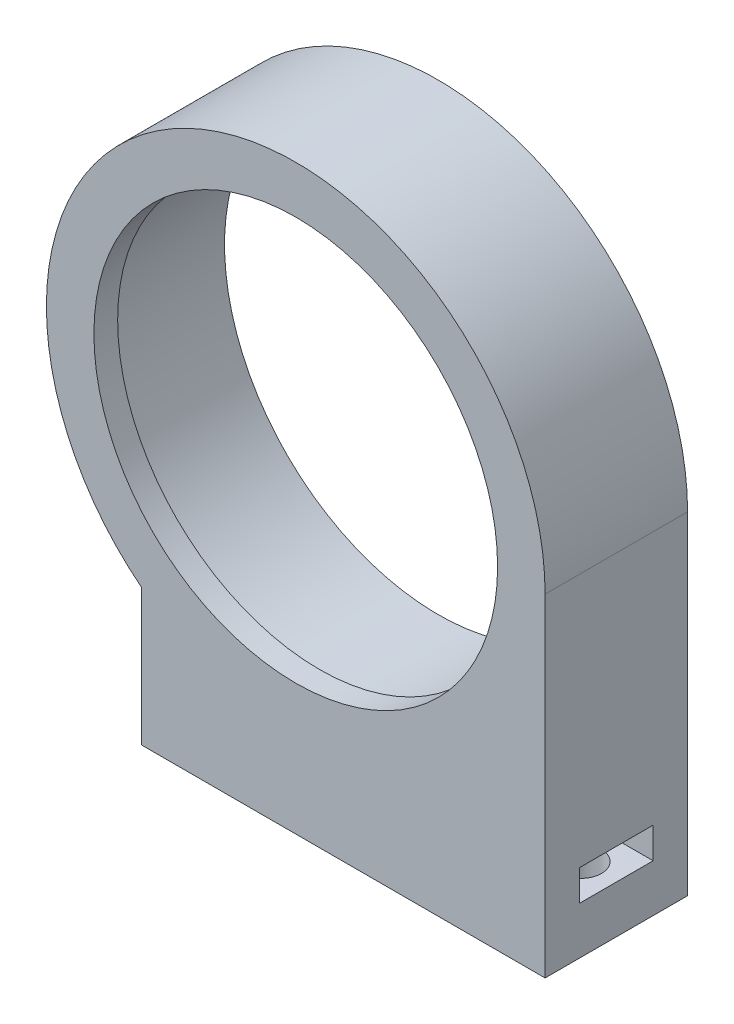
ISO-10303-21;
HEADER;
FILE_DESCRIPTION(('STEP AP214'),'2;1');
FILE_NAME('part.step','',(''),(''),'','','');
FILE_SCHEMA(('AUTOMOTIVE_DESIGN { 1 0 10303 214 1 1 1 1 }'));
ENDSEC;
DATA;
#1=APPLICATION_CONTEXT('core data for automotive mechanical design processes');
#2=APPLICATION_PROTOCOL_DEFINITION('international standard','automotive_design',2000,#1);
#3=PRODUCT_CONTEXT('',#1,'mechanical');
#4=PRODUCT('Part','Part','',(#3));
#5=PRODUCT_RELATED_PRODUCT_CATEGORY('part','',(#4));
#6=PRODUCT_DEFINITION_FORMATION('','',#4);
#7=PRODUCT_DEFINITION_CONTEXT('part definition',#1,'design');
#8=PRODUCT_DEFINITION('design','',#6,#7);
#9=PRODUCT_DEFINITION_SHAPE('','',#8);
#10=(LENGTH_UNIT() NAMED_UNIT(*) SI_UNIT(.MILLI.,.METRE.));
#11=(NAMED_UNIT(*) PLANE_ANGLE_UNIT() SI_UNIT($,.RADIAN.));
#12=(NAMED_UNIT(*) SI_UNIT($,.STERADIAN.) SOLID_ANGLE_UNIT());
#13=UNCERTAINTY_MEASURE_WITH_UNIT(LENGTH_MEASURE(1.E-05),#10,'distance_accuracy_value','');
#14=(GEOMETRIC_REPRESENTATION_CONTEXT(3) GLOBAL_UNCERTAINTY_ASSIGNED_CONTEXT((#13)) GLOBAL_UNIT_ASSIGNED_CONTEXT((#10,
#11,#12)) REPRESENTATION_CONTEXT('',''));
#15=CARTESIAN_POINT('',(0.,0.,0.));
#16=DIRECTION('',(0.,0.,1.));
#17=DIRECTION('',(1.,0.,0.));
#18=AXIS2_PLACEMENT_3D('',#15,#16,#17);
#19=CARTESIAN_POINT('',(-13.,-16.4924225024706,10.));
#20=DIRECTION('',(1.,0.,0.));
#21=DIRECTION('',(0.,1.,0.));
#22=AXIS2_PLACEMENT_3D('',#19,#20,#21);
#23=PLANE('',#22);
#24=DIRECTION('',(0.,-1.,0.));
#25=VECTOR('',#24,1.);
#26=CARTESIAN_POINT('',(-13.,-16.4924225024706,0.));
#27=LINE('',#26,#25);
#28=CARTESIAN_POINT('',(-13.,-16.4924225024706,0.));
#29=VERTEX_POINT('',#28);
#30=CARTESIAN_POINT('',(-13.,-28.,0.));
#31=VERTEX_POINT('',#30);
#32=EDGE_CURVE('E239',#29,#31,#27,.T.);
#33=ORIENTED_EDGE('',*,*,#32,.T.);
#34=DIRECTION('',(0.,0.,-1.));
#35=VECTOR('',#34,1.);
#36=CARTESIAN_POINT('',(-13.,-28.,10.));
#37=LINE('',#36,#35);
#38=CARTESIAN_POINT('',(-13.,-28.,12.));
#39=VERTEX_POINT('',#38);
#40=EDGE_CURVE('E45',#39,#31,#37,.T.);
#41=ORIENTED_EDGE('',*,*,#40,.F.);
#42=DIRECTION('',(0.,-1.,0.));
#43=VECTOR('',#42,1.);
#44=CARTESIAN_POINT('',(-13.,-28.,12.));
#45=LINE('',#44,#43);
#46=CARTESIAN_POINT('',(-13.,-16.4924225024706,12.));
#47=VERTEX_POINT('',#46);
#48=EDGE_CURVE('E216',#47,#39,#45,.T.);
#49=ORIENTED_EDGE('',*,*,#48,.F.);
#50=DIRECTION('',(0.,0.,-1.));
#51=VECTOR('',#50,1.);
#52=CARTESIAN_POINT('',(-13.,-16.4924225024706,10.));
#53=LINE('',#52,#51);
#54=EDGE_CURVE('E11',#47,#29,#53,.T.);
#55=ORIENTED_EDGE('',*,*,#54,.T.);
#56=EDGE_LOOP('',(#33,#41,#49,#55));
#57=FACE_BOUND('',#56,.T.);
#58=DIRECTION('',(0.,0.,-1.));
#59=VECTOR('',#58,1.);
#60=CARTESIAN_POINT('',(-13.,-21.4,2.9));
#61=LINE('',#60,#59);
#62=CARTESIAN_POINT('',(-13.,-21.4,9.1));
#63=VERTEX_POINT('',#62);
#64=CARTESIAN_POINT('',(-13.,-21.4,2.9));
#65=VERTEX_POINT('',#64);
#66=EDGE_CURVE('E193',#63,#65,#61,.T.);
#67=ORIENTED_EDGE('',*,*,#66,.F.);
#68=DIRECTION('',(0.,-1.,0.));
#69=VECTOR('',#68,1.);
#70=CARTESIAN_POINT('',(-13.,-21.4,9.1));
#71=LINE('',#70,#69);
#72=CARTESIAN_POINT('',(-13.,-24.,9.1));
#73=VERTEX_POINT('',#72);
#74=EDGE_CURVE('E174',#63,#73,#71,.T.);
#75=ORIENTED_EDGE('',*,*,#74,.T.);
#76=DIRECTION('',(0.,0.,-1.));
#77=VECTOR('',#76,1.);
#78=CARTESIAN_POINT('',(-13.,-24.,2.9));
#79=LINE('',#78,#77);
#80=CARTESIAN_POINT('',(-13.,-24.,2.9));
#81=VERTEX_POINT('',#80);
#82=EDGE_CURVE('E182',#73,#81,#79,.T.);
#83=ORIENTED_EDGE('',*,*,#82,.T.);
#84=DIRECTION('',(0.,-1.,0.));
#85=VECTOR('',#84,1.);
#86=CARTESIAN_POINT('',(-13.,-21.4,2.9));
#87=LINE('',#86,#85);
#88=EDGE_CURVE('E177',#65,#81,#87,.T.);
#89=ORIENTED_EDGE('',*,*,#88,.F.);
#90=EDGE_LOOP('',(#67,#75,#83,#89));
#91=FACE_BOUND('',#90,.T.);
#92=ADVANCED_FACE('F36',(#57,#91),#23,.F.);
#93=CARTESIAN_POINT('',(21.,-28.,10.));
#94=DIRECTION('',(-1.,0.,0.));
#95=DIRECTION('',(0.,0.,1.));
#96=AXIS2_PLACEMENT_3D('',#93,#94,#95);
#97=PLANE('',#96);
#98=DIRECTION('',(0.,1.,0.));
#99=VECTOR('',#98,1.);
#100=CARTESIAN_POINT('',(21.,-28.,0.));
#101=LINE('',#100,#99);
#102=CARTESIAN_POINT('',(21.,-28.,0.));
#103=VERTEX_POINT('',#102);
#104=CARTESIAN_POINT('',(21.,0.,0.));
#105=VERTEX_POINT('',#104);
#106=EDGE_CURVE('E243',#103,#105,#101,.T.);
#107=ORIENTED_EDGE('',*,*,#106,.T.);
#108=DIRECTION('',(0.,0.,-1.));
#109=VECTOR('',#108,1.);
#110=CARTESIAN_POINT('',(21.,0.,10.));
#111=LINE('',#110,#109);
#112=CARTESIAN_POINT('',(21.,0.,12.));
#113=VERTEX_POINT('',#112);
#114=EDGE_CURVE('E245',#113,#105,#111,.T.);
#115=ORIENTED_EDGE('',*,*,#114,.F.);
#116=DIRECTION('',(0.,1.,0.));
#117=VECTOR('',#116,1.);
#118=CARTESIAN_POINT('',(21.,0.,12.));
#119=LINE('',#118,#117);
#120=CARTESIAN_POINT('',(21.,-28.,12.));
#121=VERTEX_POINT('',#120);
#122=EDGE_CURVE('E224',#121,#113,#119,.T.);
#123=ORIENTED_EDGE('',*,*,#122,.F.);
#124=DIRECTION('',(0.,0.,-1.));
#125=VECTOR('',#124,1.);
#126=CARTESIAN_POINT('',(21.,-28.,10.));
#127=LINE('',#126,#125);
#128=EDGE_CURVE('E248',#121,#103,#127,.T.);
#129=ORIENTED_EDGE('',*,*,#128,.T.);
#130=EDGE_LOOP('',(#107,#115,#123,#129));
#131=FACE_BOUND('',#130,.T.);
#132=DIRECTION('',(0.,0.,1.));
#133=VECTOR('',#132,1.);
#134=CARTESIAN_POINT('',(21.,-21.4,2.9));
#135=LINE('',#134,#133);
#136=CARTESIAN_POINT('',(21.,-21.4,2.9));
#137=VERTEX_POINT('',#136);
#138=CARTESIAN_POINT('',(21.,-21.4,9.1));
#139=VERTEX_POINT('',#138);
#140=EDGE_CURVE('E148',#137,#139,#135,.T.);
#141=ORIENTED_EDGE('',*,*,#140,.F.);
#142=DIRECTION('',(0.,-1.,0.));
#143=VECTOR('',#142,1.);
#144=CARTESIAN_POINT('',(21.,-21.4,2.9));
#145=LINE('',#144,#143);
#146=CARTESIAN_POINT('',(21.,-24.,2.9));
#147=VERTEX_POINT('',#146);
#148=EDGE_CURVE('E139',#137,#147,#145,.T.);
#149=ORIENTED_EDGE('',*,*,#148,.T.);
#150=DIRECTION('',(0.,0.,1.));
#151=VECTOR('',#150,1.);
#152=CARTESIAN_POINT('',(21.,-24.,2.9));
#153=LINE('',#152,#151);
#154=CARTESIAN_POINT('',(21.,-24.,9.1));
#155=VERTEX_POINT('',#154);
#156=EDGE_CURVE('E154',#147,#155,#153,.T.);
#157=ORIENTED_EDGE('',*,*,#156,.T.);
#158=DIRECTION('',(0.,-1.,0.));
#159=VECTOR('',#158,1.);
#160=CARTESIAN_POINT('',(21.,-21.4,9.1));
#161=LINE('',#160,#159);
#162=EDGE_CURVE('E168',#139,#155,#161,.T.);
#163=ORIENTED_EDGE('',*,*,#162,.F.);
#164=EDGE_LOOP('',(#141,#149,#157,#163));
#165=FACE_BOUND('',#164,.T.);
#166=ADVANCED_FACE('F281',(#131,#165),#97,.F.);
#167=CARTESIAN_POINT('',(0.,0.,0.));
#168=DIRECTION('',(0.,0.,1.));
#169=DIRECTION('',(1.,0.,0.));
#170=AXIS2_PLACEMENT_3D('',#167,#168,#169);
#171=PLANE('',#170);
#172=CARTESIAN_POINT('',(0.,0.,0.));
#173=DIRECTION('',(0.,0.,1.));
#174=DIRECTION('',(1.,0.,0.));
#175=AXIS2_PLACEMENT_3D('',#172,#173,#174);
#176=CIRCLE('',#175,21.);
#177=EDGE_CURVE('E236',#105,#29,#176,.T.);
#178=ORIENTED_EDGE('',*,*,#177,.F.);
#179=ORIENTED_EDGE('',*,*,#106,.F.);
#180=DIRECTION('',(1.,0.,0.));
#181=VECTOR('',#180,1.);
#182=CARTESIAN_POINT('',(-13.,-28.,0.));
#183=LINE('',#182,#181);
#184=EDGE_CURVE('E241',#31,#103,#183,.T.);
#185=ORIENTED_EDGE('',*,*,#184,.F.);
#186=ORIENTED_EDGE('',*,*,#32,.F.);
#187=EDGE_LOOP('',(#178,#179,#185,#186));
#188=FACE_BOUND('',#187,.T.);
#189=CARTESIAN_POINT('',(0.,0.,0.));
#190=DIRECTION('',(0.,0.,1.));
#191=DIRECTION('',(1.,0.,0.));
#192=AXIS2_PLACEMENT_3D('',#189,#190,#191);
#193=CIRCLE('',#192,18.);
#194=CARTESIAN_POINT('',(18.,0.,0.));
#195=VERTEX_POINT('',#194);
#196=EDGE_CURVE('E233',#195,#195,#193,.T.);
#197=ORIENTED_EDGE('',*,*,#196,.T.);
#198=EDGE_LOOP('',(#197));
#199=FACE_BOUND('',#198,.T.);
#200=ADVANCED_FACE('F286',(#188,#199),#171,.F.);
#201=CARTESIAN_POINT('',(0.,0.,10.));
#202=DIRECTION('',(0.,0.,-1.));
#203=DIRECTION('',(-1.,0.,0.));
#204=AXIS2_PLACEMENT_3D('',#201,#202,#203);
#205=CYLINDRICAL_SURFACE('',#204,21.);
#206=ORIENTED_EDGE('',*,*,#177,.T.);
#207=ORIENTED_EDGE('',*,*,#54,.F.);
#208=CARTESIAN_POINT('',(0.,0.,12.));
#209=DIRECTION('',(0.,0.,1.));
#210=DIRECTION('',(1.,0.,0.));
#211=AXIS2_PLACEMENT_3D('',#208,#209,#210);
#212=CIRCLE('',#211,21.);
#213=EDGE_CURVE('E227',#113,#47,#212,.T.);
#214=ORIENTED_EDGE('',*,*,#213,.F.);
#215=ORIENTED_EDGE('',*,*,#114,.T.);
#216=EDGE_LOOP('',(#206,#207,#214,#215));
#217=FACE_BOUND('',#216,.T.);
#218=ADVANCED_FACE('F38',(#217),#205,.T.);
#219=CARTESIAN_POINT('',(-13.,-28.,10.));
#220=DIRECTION('',(0.,1.,0.));
#221=DIRECTION('',(-1.,0.,0.));
#222=AXIS2_PLACEMENT_3D('',#219,#220,#221);
#223=PLANE('',#222);
#224=CARTESIAN_POINT('',(-10.,-28.,6.));
#225=DIRECTION('',(0.,-1.,0.));
#226=DIRECTION('',(1.,0.,0.));
#227=AXIS2_PLACEMENT_3D('',#224,#225,#226);
#228=CIRCLE('',#227,1.75);
#229=CARTESIAN_POINT('',(-8.25,-28.,6.));
#230=VERTEX_POINT('',#229);
#231=EDGE_CURVE('E204',#230,#230,#228,.T.);
#232=ORIENTED_EDGE('',*,*,#231,.F.);
#233=EDGE_LOOP('',(#232));
#234=FACE_BOUND('',#233,.T.);
#235=CARTESIAN_POINT('',(18.,-28.,6.));
#236=DIRECTION('',(0.,-1.,0.));
#237=DIRECTION('',(1.,0.,0.));
#238=AXIS2_PLACEMENT_3D('',#235,#236,#237);
#239=CIRCLE('',#238,1.75);
#240=CARTESIAN_POINT('',(19.75,-28.,6.));
#241=VERTEX_POINT('',#240);
#242=EDGE_CURVE('E207',#241,#241,#239,.T.);
#243=ORIENTED_EDGE('',*,*,#242,.F.);
#244=EDGE_LOOP('',(#243));
#245=FACE_BOUND('',#244,.T.);
#246=ORIENTED_EDGE('',*,*,#184,.T.);
#247=ORIENTED_EDGE('',*,*,#128,.F.);
#248=DIRECTION('',(1.,0.,0.));
#249=VECTOR('',#248,1.);
#250=CARTESIAN_POINT('',(21.,-28.,12.));
#251=LINE('',#250,#249);
#252=EDGE_CURVE('E221',#39,#121,#251,.T.);
#253=ORIENTED_EDGE('',*,*,#252,.F.);
#254=ORIENTED_EDGE('',*,*,#40,.T.);
#255=EDGE_LOOP('',(#246,#247,#253,#254));
#256=FACE_BOUND('',#255,.T.);
#257=ADVANCED_FACE('F291',(#234,#245,#256),#223,.F.);
#258=CARTESIAN_POINT('',(0.,0.,10.));
#259=DIRECTION('',(0.,0.,-1.));
#260=DIRECTION('',(-1.,0.,0.));
#261=AXIS2_PLACEMENT_3D('',#258,#259,#260);
#262=CYLINDRICAL_SURFACE('',#261,18.);
#263=CARTESIAN_POINT('',(0.,0.,10.));
#264=DIRECTION('',(0.,0.,1.));
#265=DIRECTION('',(1.,0.,0.));
#266=AXIS2_PLACEMENT_3D('',#263,#264,#265);
#267=CIRCLE('',#266,18.);
#268=CARTESIAN_POINT('',(18.,0.,10.));
#269=VERTEX_POINT('',#268);
#270=EDGE_CURVE('E230',#269,#269,#267,.T.);
#271=ORIENTED_EDGE('',*,*,#270,.T.);
#272=EDGE_LOOP('',(#271));
#273=FACE_BOUND('',#272,.T.);
#274=ORIENTED_EDGE('',*,*,#196,.F.);
#275=EDGE_LOOP('',(#274));
#276=FACE_BOUND('',#275,.T.);
#277=ADVANCED_FACE('F293',(#273,#276),#262,.F.);
#278=CARTESIAN_POINT('',(0.,0.,10.));
#279=DIRECTION('',(0.,0.,1.));
#280=DIRECTION('',(1.,0.,0.));
#281=AXIS2_PLACEMENT_3D('',#278,#279,#280);
#282=PLANE('',#281);
#283=CARTESIAN_POINT('',(0.,0.,10.));
#284=DIRECTION('',(0.,0.,1.));
#285=DIRECTION('',(1.,0.,0.));
#286=AXIS2_PLACEMENT_3D('',#283,#284,#285);
#287=CIRCLE('',#286,17.);
#288=CARTESIAN_POINT('',(17.,0.,10.));
#289=VERTEX_POINT('',#288);
#290=EDGE_CURVE('E203',#289,#289,#287,.T.);
#291=ORIENTED_EDGE('',*,*,#290,.T.);
#292=EDGE_LOOP('',(#291));
#293=FACE_BOUND('',#292,.T.);
#294=ORIENTED_EDGE('',*,*,#270,.F.);
#295=EDGE_LOOP('',(#294));
#296=FACE_BOUND('',#295,.T.);
#297=ADVANCED_FACE('F301',(#293,#296),#282,.F.);
#298=CARTESIAN_POINT('',(0.,0.,12.));
#299=DIRECTION('',(0.,0.,1.));
#300=DIRECTION('',(1.,0.,0.));
#301=AXIS2_PLACEMENT_3D('',#298,#299,#300);
#302=PLANE('',#301);
#303=ORIENTED_EDGE('',*,*,#48,.T.);
#304=ORIENTED_EDGE('',*,*,#252,.T.);
#305=ORIENTED_EDGE('',*,*,#122,.T.);
#306=ORIENTED_EDGE('',*,*,#213,.T.);
#307=EDGE_LOOP('',(#303,#304,#305,#306));
#308=FACE_BOUND('',#307,.T.);
#309=CARTESIAN_POINT('',(0.,0.,12.));
#310=DIRECTION('',(0.,0.,1.));
#311=DIRECTION('',(1.,0.,0.));
#312=AXIS2_PLACEMENT_3D('',#309,#310,#311);
#313=CIRCLE('',#312,17.);
#314=CARTESIAN_POINT('',(17.,0.,12.));
#315=VERTEX_POINT('',#314);
#316=EDGE_CURVE('E213',#315,#315,#313,.T.);
#317=ORIENTED_EDGE('',*,*,#316,.F.);
#318=EDGE_LOOP('',(#317));
#319=FACE_BOUND('',#318,.T.);
#320=ADVANCED_FACE('F305',(#308,#319),#302,.T.);
#321=CARTESIAN_POINT('',(0.,0.,12.));
#322=DIRECTION('',(0.,0.,-1.));
#323=DIRECTION('',(-1.,0.,0.));
#324=AXIS2_PLACEMENT_3D('',#321,#322,#323);
#325=CYLINDRICAL_SURFACE('',#324,17.);
#326=ORIENTED_EDGE('',*,*,#316,.T.);
#327=EDGE_LOOP('',(#326));
#328=FACE_BOUND('',#327,.T.);
#329=ORIENTED_EDGE('',*,*,#290,.F.);
#330=EDGE_LOOP('',(#329));
#331=FACE_BOUND('',#330,.T.);
#332=ADVANCED_FACE('F279',(#328,#331),#325,.F.);
#333=CARTESIAN_POINT('',(18.,-20.,6.));
#334=DIRECTION('',(0.,-1.,0.));
#335=DIRECTION('',(1.,0.,0.));
#336=AXIS2_PLACEMENT_3D('',#333,#334,#335);
#337=CYLINDRICAL_SURFACE('',#336,1.75);
#338=CARTESIAN_POINT('',(18.,-24.,6.));
#339=DIRECTION('',(0.,-1.,0.));
#340=DIRECTION('',(1.,0.,0.));
#341=AXIS2_PLACEMENT_3D('',#338,#339,#340);
#342=CIRCLE('',#341,1.75);
#343=CARTESIAN_POINT('',(19.75,-24.,6.));
#344=VERTEX_POINT('',#343);
#345=EDGE_CURVE('E257',#344,#344,#342,.F.);
#346=ORIENTED_EDGE('',*,*,#345,.T.);
#347=EDGE_LOOP('',(#346));
#348=FACE_BOUND('',#347,.T.);
#349=ORIENTED_EDGE('',*,*,#242,.T.);
#350=EDGE_LOOP('',(#349));
#351=FACE_BOUND('',#350,.T.);
#352=ADVANCED_FACE('F269',(#348,#351),#337,.F.);
#353=CARTESIAN_POINT('',(-10.,-20.,6.));
#354=DIRECTION('',(0.,-1.,0.));
#355=DIRECTION('',(1.,0.,0.));
#356=AXIS2_PLACEMENT_3D('',#353,#354,#355);
#357=CYLINDRICAL_SURFACE('',#356,1.75);
#358=CARTESIAN_POINT('',(-10.,-24.,6.));
#359=DIRECTION('',(0.,-1.,0.));
#360=DIRECTION('',(1.,0.,0.));
#361=AXIS2_PLACEMENT_3D('',#358,#359,#360);
#362=CIRCLE('',#361,1.75);
#363=CARTESIAN_POINT('',(-8.25,-24.,6.));
#364=VERTEX_POINT('',#363);
#365=EDGE_CURVE('E167',#364,#364,#362,.F.);
#366=ORIENTED_EDGE('',*,*,#365,.T.);
#367=EDGE_LOOP('',(#366));
#368=FACE_BOUND('',#367,.T.);
#369=ORIENTED_EDGE('',*,*,#231,.T.);
#370=EDGE_LOOP('',(#369));
#371=FACE_BOUND('',#370,.T.);
#372=ADVANCED_FACE('F278',(#368,#371),#357,.F.);
#373=CARTESIAN_POINT('',(-10.,-21.4,6.));
#374=DIRECTION('',(0.,-1.,0.));
#375=DIRECTION('',(1.,0.,0.));
#376=AXIS2_PLACEMENT_3D('',#373,#374,#375);
#377=PLANE('',#376);
#378=CARTESIAN_POINT('',(-10.,-21.4,6.));
#379=DIRECTION('',(0.,-1.,0.));
#380=DIRECTION('',(1.,0.,0.));
#381=AXIS2_PLACEMENT_3D('',#378,#379,#380);
#382=CIRCLE('',#381,3.1);
#383=CARTESIAN_POINT('',(-10.,-21.4,2.9));
#384=VERTEX_POINT('',#383);
#385=CARTESIAN_POINT('',(-10.,-21.4,9.1));
#386=VERTEX_POINT('',#385);
#387=EDGE_CURVE('E183',#384,#386,#382,.T.);
#388=ORIENTED_EDGE('',*,*,#387,.T.);
#389=DIRECTION('',(-1.,0.,0.));
#390=VECTOR('',#389,1.);
#391=CARTESIAN_POINT('',(-10.,-21.4,9.1));
#392=LINE('',#391,#390);
#393=EDGE_CURVE('E195',#386,#63,#392,.T.);
#394=ORIENTED_EDGE('',*,*,#393,.T.);
#395=ORIENTED_EDGE('',*,*,#66,.T.);
#396=DIRECTION('',(1.,0.,0.));
#397=VECTOR('',#396,1.);
#398=CARTESIAN_POINT('',(-10.,-21.4,2.9));
#399=LINE('',#398,#397);
#400=EDGE_CURVE('E173',#65,#384,#399,.T.);
#401=ORIENTED_EDGE('',*,*,#400,.T.);
#402=EDGE_LOOP('',(#388,#394,#395,#401));
#403=FACE_BOUND('',#402,.T.);
#404=CARTESIAN_POINT('',(-10.,-21.4,6.));
#405=DIRECTION('',(0.,-1.,0.));
#406=DIRECTION('',(1.,0.,0.));
#407=AXIS2_PLACEMENT_3D('',#404,#405,#406);
#408=CIRCLE('',#407,1.75);
#409=CARTESIAN_POINT('',(-8.25,-21.4,6.));
#410=VERTEX_POINT('',#409);
#411=EDGE_CURVE('E255',#410,#410,#408,.F.);
#412=ORIENTED_EDGE('',*,*,#411,.T.);
#413=EDGE_LOOP('',(#412));
#414=FACE_BOUND('',#413,.T.);
#415=ADVANCED_FACE('F337',(#403,#414),#377,.T.);
#416=CARTESIAN_POINT('',(-10.,-24.,6.));
#417=DIRECTION('',(0.,-1.,0.));
#418=DIRECTION('',(1.,0.,0.));
#419=AXIS2_PLACEMENT_3D('',#416,#417,#418);
#420=PLANE('',#419);
#421=CARTESIAN_POINT('',(-10.,-24.,6.));
#422=DIRECTION('',(0.,-1.,0.));
#423=DIRECTION('',(1.,0.,0.));
#424=AXIS2_PLACEMENT_3D('',#421,#422,#423);
#425=CIRCLE('',#424,3.1);
#426=CARTESIAN_POINT('',(-10.,-24.,2.9));
#427=VERTEX_POINT('',#426);
#428=CARTESIAN_POINT('',(-10.,-24.,9.1));
#429=VERTEX_POINT('',#428);
#430=EDGE_CURVE('E161',#427,#429,#425,.T.);
#431=ORIENTED_EDGE('',*,*,#430,.F.);
#432=DIRECTION('',(1.,0.,0.));
#433=VECTOR('',#432,1.);
#434=CARTESIAN_POINT('',(-10.,-24.,2.9));
#435=LINE('',#434,#433);
#436=EDGE_CURVE('E53',#81,#427,#435,.T.);
#437=ORIENTED_EDGE('',*,*,#436,.F.);
#438=ORIENTED_EDGE('',*,*,#82,.F.);
#439=DIRECTION('',(-1.,0.,0.));
#440=VECTOR('',#439,1.);
#441=CARTESIAN_POINT('',(-10.,-24.,9.1));
#442=LINE('',#441,#440);
#443=EDGE_CURVE('E186',#429,#73,#442,.T.);
#444=ORIENTED_EDGE('',*,*,#443,.F.);
#445=EDGE_LOOP('',(#431,#437,#438,#444));
#446=FACE_BOUND('',#445,.T.);
#447=ORIENTED_EDGE('',*,*,#365,.F.);
#448=EDGE_LOOP('',(#447));
#449=FACE_BOUND('',#448,.T.);
#450=ADVANCED_FACE('F345',(#446,#449),#420,.F.);
#451=CARTESIAN_POINT('',(-10.,-21.4,6.));
#452=DIRECTION('',(0.,-1.,0.));
#453=DIRECTION('',(1.,0.,0.));
#454=AXIS2_PLACEMENT_3D('',#451,#452,#453);
#455=CYLINDRICAL_SURFACE('',#454,3.1);
#456=ORIENTED_EDGE('',*,*,#430,.T.);
#457=DIRECTION('',(0.,-1.,0.));
#458=VECTOR('',#457,1.);
#459=CARTESIAN_POINT('',(-10.,-21.4,9.1));
#460=LINE('',#459,#458);
#461=EDGE_CURVE('E171',#386,#429,#460,.T.);
#462=ORIENTED_EDGE('',*,*,#461,.F.);
#463=ORIENTED_EDGE('',*,*,#387,.F.);
#464=DIRECTION('',(0.,-1.,0.));
#465=VECTOR('',#464,1.);
#466=CARTESIAN_POINT('',(-10.,-21.4,2.9));
#467=LINE('',#466,#465);
#468=EDGE_CURVE('E179',#384,#427,#467,.T.);
#469=ORIENTED_EDGE('',*,*,#468,.T.);
#470=EDGE_LOOP('',(#456,#462,#463,#469));
#471=FACE_BOUND('',#470,.T.);
#472=ADVANCED_FACE('F353',(#471),#455,.F.);
#473=CARTESIAN_POINT('',(-10.,-21.4,2.9));
#474=DIRECTION('',(0.,0.,-1.));
#475=DIRECTION('',(-1.,0.,0.));
#476=AXIS2_PLACEMENT_3D('',#473,#474,#475);
#477=PLANE('',#476);
#478=ORIENTED_EDGE('',*,*,#436,.T.);
#479=ORIENTED_EDGE('',*,*,#468,.F.);
#480=ORIENTED_EDGE('',*,*,#400,.F.);
#481=ORIENTED_EDGE('',*,*,#88,.T.);
#482=EDGE_LOOP('',(#478,#479,#480,#481));
#483=FACE_BOUND('',#482,.T.);
#484=ADVANCED_FACE('F360',(#483),#477,.F.);
#485=CARTESIAN_POINT('',(-10.,-21.4,9.1));
#486=DIRECTION('',(0.,0.,1.));
#487=DIRECTION('',(1.,0.,0.));
#488=AXIS2_PLACEMENT_3D('',#485,#486,#487);
#489=PLANE('',#488);
#490=ORIENTED_EDGE('',*,*,#443,.T.);
#491=ORIENTED_EDGE('',*,*,#74,.F.);
#492=ORIENTED_EDGE('',*,*,#393,.F.);
#493=ORIENTED_EDGE('',*,*,#461,.T.);
#494=EDGE_LOOP('',(#490,#491,#492,#493));
#495=FACE_BOUND('',#494,.T.);
#496=ADVANCED_FACE('F368',(#495),#489,.F.);
#497=CARTESIAN_POINT('',(-10.,-20.,6.));
#498=DIRECTION('',(0.,-1.,0.));
#499=DIRECTION('',(1.,0.,0.));
#500=AXIS2_PLACEMENT_3D('',#497,#498,#499);
#501=PLANE('',#500);
#502=CARTESIAN_POINT('',(-10.,-20.,6.));
#503=DIRECTION('',(0.,-1.,0.));
#504=DIRECTION('',(1.,0.,0.));
#505=AXIS2_PLACEMENT_3D('',#502,#503,#504);
#506=CIRCLE('',#505,1.75);
#507=CARTESIAN_POINT('',(-8.25,-20.,6.));
#508=VERTEX_POINT('',#507);
#509=EDGE_CURVE('E200',#508,#508,#506,.T.);
#510=ORIENTED_EDGE('',*,*,#509,.T.);
#511=EDGE_LOOP('',(#510));
#512=FACE_BOUND('',#511,.T.);
#513=ADVANCED_FACE('F376',(#512),#501,.T.);
#514=ORIENTED_EDGE('',*,*,#509,.F.);
#515=EDGE_LOOP('',(#514));
#516=FACE_BOUND('',#515,.T.);
#517=ORIENTED_EDGE('',*,*,#411,.F.);
#518=EDGE_LOOP('',(#517));
#519=FACE_BOUND('',#518,.T.);
#520=ADVANCED_FACE('F339',(#516,#519),#357,.F.);
#521=CARTESIAN_POINT('',(18.,-21.4,6.));
#522=DIRECTION('',(0.,-1.,0.));
#523=DIRECTION('',(1.,0.,0.));
#524=AXIS2_PLACEMENT_3D('',#521,#522,#523);
#525=PLANE('',#524);
#526=CARTESIAN_POINT('',(18.,-21.4,6.));
#527=DIRECTION('',(0.,-1.,0.));
#528=DIRECTION('',(1.,0.,0.));
#529=AXIS2_PLACEMENT_3D('',#526,#527,#528);
#530=CIRCLE('',#529,3.1);
#531=CARTESIAN_POINT('',(18.,-21.4,9.1));
#532=VERTEX_POINT('',#531);
#533=CARTESIAN_POINT('',(18.,-21.4,2.9));
#534=VERTEX_POINT('',#533);
#535=EDGE_CURVE('E133',#532,#534,#530,.T.);
#536=ORIENTED_EDGE('',*,*,#535,.T.);
#537=DIRECTION('',(1.,0.,0.));
#538=VECTOR('',#537,1.);
#539=CARTESIAN_POINT('',(18.,-21.4,2.9));
#540=LINE('',#539,#538);
#541=EDGE_CURVE('E143',#534,#137,#540,.T.);
#542=ORIENTED_EDGE('',*,*,#541,.T.);
#543=ORIENTED_EDGE('',*,*,#140,.T.);
#544=DIRECTION('',(-1.,0.,0.));
#545=VECTOR('',#544,1.);
#546=CARTESIAN_POINT('',(18.,-21.4,9.1));
#547=LINE('',#546,#545);
#548=EDGE_CURVE('E140',#139,#532,#547,.T.);
#549=ORIENTED_EDGE('',*,*,#548,.T.);
#550=EDGE_LOOP('',(#536,#542,#543,#549));
#551=FACE_BOUND('',#550,.T.);
#552=CARTESIAN_POINT('',(18.,-21.4,6.));
#553=DIRECTION('',(0.,-1.,0.));
#554=DIRECTION('',(1.,0.,0.));
#555=AXIS2_PLACEMENT_3D('',#552,#553,#554);
#556=CIRCLE('',#555,1.75);
#557=CARTESIAN_POINT('',(19.75,-21.4,6.));
#558=VERTEX_POINT('',#557);
#559=EDGE_CURVE('E40',#558,#558,#556,.F.);
#560=ORIENTED_EDGE('',*,*,#559,.T.);
#561=EDGE_LOOP('',(#560));
#562=FACE_BOUND('',#561,.T.);
#563=ADVANCED_FACE('F150',(#551,#562),#525,.T.);
#564=CARTESIAN_POINT('',(18.,-24.,6.));
#565=DIRECTION('',(0.,-1.,0.));
#566=DIRECTION('',(1.,0.,0.));
#567=AXIS2_PLACEMENT_3D('',#564,#565,#566);
#568=PLANE('',#567);
#569=CARTESIAN_POINT('',(18.,-24.,6.));
#570=DIRECTION('',(0.,-1.,0.));
#571=DIRECTION('',(1.,0.,0.));
#572=AXIS2_PLACEMENT_3D('',#569,#570,#571);
#573=CIRCLE('',#572,3.1);
#574=CARTESIAN_POINT('',(18.,-24.,9.1));
#575=VERTEX_POINT('',#574);
#576=CARTESIAN_POINT('',(18.,-24.,2.9));
#577=VERTEX_POINT('',#576);
#578=EDGE_CURVE('E135',#575,#577,#573,.T.);
#579=ORIENTED_EDGE('',*,*,#578,.F.);
#580=DIRECTION('',(-1.,0.,0.));
#581=VECTOR('',#580,1.);
#582=CARTESIAN_POINT('',(18.,-24.,9.1));
#583=LINE('',#582,#581);
#584=EDGE_CURVE('E61',#155,#575,#583,.T.);
#585=ORIENTED_EDGE('',*,*,#584,.F.);
#586=ORIENTED_EDGE('',*,*,#156,.F.);
#587=DIRECTION('',(1.,0.,0.));
#588=VECTOR('',#587,1.);
#589=CARTESIAN_POINT('',(18.,-24.,2.9));
#590=LINE('',#589,#588);
#591=EDGE_CURVE('E160',#577,#147,#590,.T.);
#592=ORIENTED_EDGE('',*,*,#591,.F.);
#593=EDGE_LOOP('',(#579,#585,#586,#592));
#594=FACE_BOUND('',#593,.T.);
#595=ORIENTED_EDGE('',*,*,#345,.F.);
#596=EDGE_LOOP('',(#595));
#597=FACE_BOUND('',#596,.T.);
#598=ADVANCED_FACE('F398',(#594,#597),#568,.F.);
#599=CARTESIAN_POINT('',(18.,-21.4,6.));
#600=DIRECTION('',(0.,-1.,0.));
#601=DIRECTION('',(1.,0.,0.));
#602=AXIS2_PLACEMENT_3D('',#599,#600,#601);
#603=CYLINDRICAL_SURFACE('',#602,3.1);
#604=ORIENTED_EDGE('',*,*,#578,.T.);
#605=DIRECTION('',(0.,-1.,0.));
#606=VECTOR('',#605,1.);
#607=CARTESIAN_POINT('',(18.,-21.4,2.9));
#608=LINE('',#607,#606);
#609=EDGE_CURVE('E129',#534,#577,#608,.T.);
#610=ORIENTED_EDGE('',*,*,#609,.F.);
#611=ORIENTED_EDGE('',*,*,#535,.F.);
#612=DIRECTION('',(0.,-1.,0.));
#613=VECTOR('',#612,1.);
#614=CARTESIAN_POINT('',(18.,-21.4,9.1));
#615=LINE('',#614,#613);
#616=EDGE_CURVE('E165',#532,#575,#615,.T.);
#617=ORIENTED_EDGE('',*,*,#616,.T.);
#618=EDGE_LOOP('',(#604,#610,#611,#617));
#619=FACE_BOUND('',#618,.T.);
#620=ADVANCED_FACE('F131',(#619),#603,.F.);
#621=CARTESIAN_POINT('',(18.,-21.4,9.1));
#622=DIRECTION('',(0.,0.,1.));
#623=DIRECTION('',(1.,0.,0.));
#624=AXIS2_PLACEMENT_3D('',#621,#622,#623);
#625=PLANE('',#624);
#626=ORIENTED_EDGE('',*,*,#584,.T.);
#627=ORIENTED_EDGE('',*,*,#616,.F.);
#628=ORIENTED_EDGE('',*,*,#548,.F.);
#629=ORIENTED_EDGE('',*,*,#162,.T.);
#630=EDGE_LOOP('',(#626,#627,#628,#629));
#631=FACE_BOUND('',#630,.T.);
#632=ADVANCED_FACE('F411',(#631),#625,.F.);
#633=CARTESIAN_POINT('',(18.,-21.4,2.9));
#634=DIRECTION('',(0.,0.,-1.));
#635=DIRECTION('',(-1.,0.,0.));
#636=AXIS2_PLACEMENT_3D('',#633,#634,#635);
#637=PLANE('',#636);
#638=ORIENTED_EDGE('',*,*,#591,.T.);
#639=ORIENTED_EDGE('',*,*,#148,.F.);
#640=ORIENTED_EDGE('',*,*,#541,.F.);
#641=ORIENTED_EDGE('',*,*,#609,.T.);
#642=EDGE_LOOP('',(#638,#639,#640,#641));
#643=FACE_BOUND('',#642,.T.);
#644=ADVANCED_FACE('F144',(#643),#637,.F.);
#645=CARTESIAN_POINT('',(18.,-20.,6.));
#646=DIRECTION('',(0.,-1.,0.));
#647=DIRECTION('',(1.,0.,0.));
#648=AXIS2_PLACEMENT_3D('',#645,#646,#647);
#649=PLANE('',#648);
#650=CARTESIAN_POINT('',(18.,-20.,6.));
#651=DIRECTION('',(0.,-1.,0.));
#652=DIRECTION('',(1.,0.,0.));
#653=AXIS2_PLACEMENT_3D('',#650,#651,#652);
#654=CIRCLE('',#653,1.75);
#655=CARTESIAN_POINT('',(19.75,-20.,6.));
#656=VERTEX_POINT('',#655);
#657=EDGE_CURVE('E210',#656,#656,#654,.T.);
#658=ORIENTED_EDGE('',*,*,#657,.T.);
#659=EDGE_LOOP('',(#658));
#660=FACE_BOUND('',#659,.T.);
#661=ADVANCED_FACE('F266',(#660),#649,.T.);
#662=ORIENTED_EDGE('',*,*,#657,.F.);
#663=EDGE_LOOP('',(#662));
#664=FACE_BOUND('',#663,.T.);
#665=ORIENTED_EDGE('',*,*,#559,.F.);
#666=EDGE_LOOP('',(#665));
#667=FACE_BOUND('',#666,.T.);
#668=ADVANCED_FACE('F264',(#664,#667),#337,.F.);
#669=CLOSED_SHELL('',(#92,#166,#200,#218,#257,#277,#297,#320,#332,#352,#372,#415,#450,#472,#484,
#496,#513,#520,#563,#598,#620,#632,#644,#661,#668));
#670=MANIFOLD_SOLID_BREP('B2',#669);
#671=ADVANCED_BREP_SHAPE_REPRESENTATION('',(#18,#670),#14);
#672=SHAPE_DEFINITION_REPRESENTATION(#9,#671);
ENDSEC;
END-ISO-10303-21;
